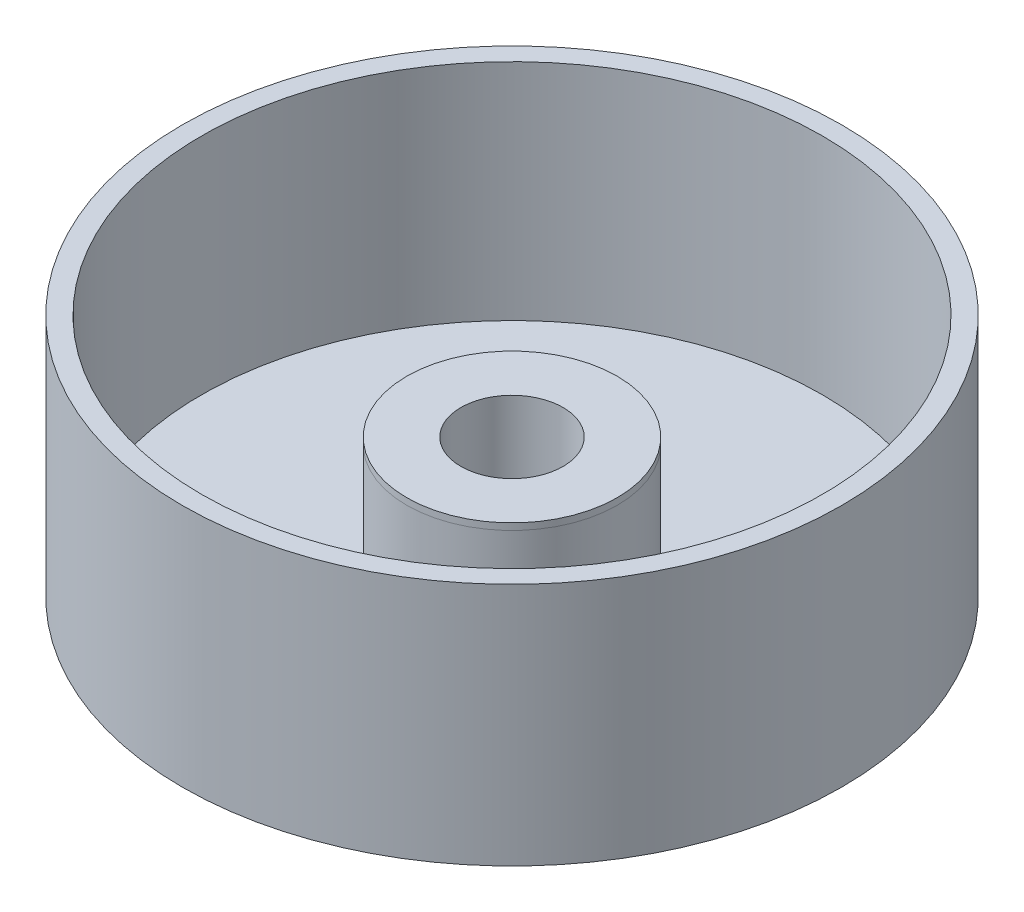
ISO-10303-21;
HEADER;
FILE_DESCRIPTION(('STEP AP214'),'2;1');
FILE_NAME('part.step','',(''),(''),'','','');
FILE_SCHEMA(('AUTOMOTIVE_DESIGN { 1 0 10303 214 1 1 1 1 }'));
ENDSEC;
DATA;
#1=APPLICATION_CONTEXT('core data for automotive mechanical design processes');
#2=APPLICATION_PROTOCOL_DEFINITION('international standard','automotive_design',2000,#1);
#3=PRODUCT_CONTEXT('',#1,'mechanical');
#4=PRODUCT('Part','Part','',(#3));
#5=PRODUCT_RELATED_PRODUCT_CATEGORY('part','',(#4));
#6=PRODUCT_DEFINITION_FORMATION('','',#4);
#7=PRODUCT_DEFINITION_CONTEXT('part definition',#1,'design');
#8=PRODUCT_DEFINITION('design','',#6,#7);
#9=PRODUCT_DEFINITION_SHAPE('','',#8);
#10=(LENGTH_UNIT() NAMED_UNIT(*) SI_UNIT(.MILLI.,.METRE.));
#11=(NAMED_UNIT(*) PLANE_ANGLE_UNIT() SI_UNIT($,.RADIAN.));
#12=(NAMED_UNIT(*) SI_UNIT($,.STERADIAN.) SOLID_ANGLE_UNIT());
#13=UNCERTAINTY_MEASURE_WITH_UNIT(LENGTH_MEASURE(1.E-05),#10,'distance_accuracy_value','');
#14=(GEOMETRIC_REPRESENTATION_CONTEXT(3) GLOBAL_UNCERTAINTY_ASSIGNED_CONTEXT((#13)) GLOBAL_UNIT_ASSIGNED_CONTEXT((#10,
#11,#12)) REPRESENTATION_CONTEXT('',''));
#15=CARTESIAN_POINT('',(0.,0.,0.));
#16=DIRECTION('',(0.,0.,1.));
#17=DIRECTION('',(1.,0.,0.));
#18=AXIS2_PLACEMENT_3D('',#15,#16,#17);
#19=CARTESIAN_POINT('',(0.,1.,0.));
#20=DIRECTION('',(0.,-1.,0.));
#21=DIRECTION('',(0.,0.,-1.));
#22=AXIS2_PLACEMENT_3D('',#19,#20,#21);
#23=CYLINDRICAL_SURFACE('',#22,15.958);
#24=CARTESIAN_POINT('',(0.,1.,0.));
#25=DIRECTION('',(0.,1.,0.));
#26=DIRECTION('',(0.,0.,1.));
#27=AXIS2_PLACEMENT_3D('',#24,#25,#26);
#28=CIRCLE('',#27,15.958);
#29=CARTESIAN_POINT('',(0.,1.,15.958));
#30=VERTEX_POINT('',#29);
#31=EDGE_CURVE('E11',#30,#30,#28,.T.);
#32=ORIENTED_EDGE('',*,*,#31,.F.);
#33=EDGE_LOOP('',(#32));
#34=FACE_BOUND('',#33,.T.);
#35=CARTESIAN_POINT('',(0.,0.,0.));
#36=DIRECTION('',(0.,1.,0.));
#37=DIRECTION('',(0.,0.,1.));
#38=AXIS2_PLACEMENT_3D('',#35,#36,#37);
#39=CIRCLE('',#38,15.958);
#40=CARTESIAN_POINT('',(0.,0.,15.958));
#41=VERTEX_POINT('',#40);
#42=EDGE_CURVE('E45',#41,#41,#39,.T.);
#43=ORIENTED_EDGE('',*,*,#42,.T.);
#44=EDGE_LOOP('',(#43));
#45=FACE_BOUND('',#44,.T.);
#46=ADVANCED_FACE('F35',(#34,#45),#23,.T.);
#47=CARTESIAN_POINT('',(0.,1.,0.));
#48=DIRECTION('',(0.,1.,0.));
#49=DIRECTION('',(0.,0.,1.));
#50=AXIS2_PLACEMENT_3D('',#47,#48,#49);
#51=PLANE('',#50);
#52=CARTESIAN_POINT('',(0.,1.,0.));
#53=DIRECTION('',(0.,1.,0.));
#54=DIRECTION('',(0.,0.,1.));
#55=AXIS2_PLACEMENT_3D('',#52,#53,#54);
#56=CIRCLE('',#55,7.75000000000001);
#57=CARTESIAN_POINT('',(0.,1.,7.75000000000001));
#58=VERTEX_POINT('',#57);
#59=EDGE_CURVE('E67',#58,#58,#56,.T.);
#60=ORIENTED_EDGE('',*,*,#59,.F.);
#61=EDGE_LOOP('',(#60));
#62=FACE_BOUND('',#61,.T.);
#63=ORIENTED_EDGE('',*,*,#31,.T.);
#64=EDGE_LOOP('',(#63));
#65=FACE_BOUND('',#64,.T.);
#66=ADVANCED_FACE('F82',(#62,#65),#51,.T.);
#67=CARTESIAN_POINT('',(0.,0.,0.));
#68=DIRECTION('',(0.,1.,0.));
#69=DIRECTION('',(0.,0.,1.));
#70=AXIS2_PLACEMENT_3D('',#67,#68,#69);
#71=PLANE('',#70);
#72=CARTESIAN_POINT('',(0.,0.,0.));
#73=DIRECTION('',(0.,1.,0.));
#74=DIRECTION('',(0.,0.,1.));
#75=AXIS2_PLACEMENT_3D('',#72,#73,#74);
#76=CIRCLE('',#75,15.9579008899185);
#77=CARTESIAN_POINT('',(0.,0.,15.9579008899185));
#78=VERTEX_POINT('',#77);
#79=EDGE_CURVE('E55',#78,#78,#76,.T.);
#80=ORIENTED_EDGE('',*,*,#79,.T.);
#81=EDGE_LOOP('',(#80));
#82=FACE_BOUND('',#81,.T.);
#83=ORIENTED_EDGE('',*,*,#42,.F.);
#84=EDGE_LOOP('',(#83));
#85=FACE_BOUND('',#84,.T.);
#86=ADVANCED_FACE('F84',(#82,#85),#71,.F.);
#87=CARTESIAN_POINT('',(0.,-153.170167860411,0.));
#88=DIRECTION('',(0.,1.,0.));
#89=DIRECTION('',(0.,0.,1.));
#90=AXIS2_PLACEMENT_3D('',#87,#88,#89);
#91=CYLINDRICAL_SURFACE('',#90,47.0827643729237);
#92=CARTESIAN_POINT('',(0.,-17.,0.));
#93=DIRECTION('',(0.,-1.,0.));
#94=DIRECTION('',(0.,0.,-1.));
#95=AXIS2_PLACEMENT_3D('',#92,#93,#94);
#96=CIRCLE('',#95,47.0827643729237);
#97=CARTESIAN_POINT('',(0.,-17.,-47.0827643729237));
#98=VERTEX_POINT('',#97);
#99=EDGE_CURVE('E52',#98,#98,#96,.F.);
#100=ORIENTED_EDGE('',*,*,#99,.F.);
#101=EDGE_LOOP('',(#100));
#102=FACE_BOUND('',#101,.T.);
#103=CARTESIAN_POINT('',(0.,17.,0.));
#104=DIRECTION('',(0.,1.,0.));
#105=DIRECTION('',(0.,0.,1.));
#106=AXIS2_PLACEMENT_3D('',#103,#104,#105);
#107=CIRCLE('',#106,47.0827643729237);
#108=CARTESIAN_POINT('',(0.,17.,47.0827643729237));
#109=VERTEX_POINT('',#108);
#110=EDGE_CURVE('E63',#109,#109,#107,.T.);
#111=ORIENTED_EDGE('',*,*,#110,.T.);
#112=EDGE_LOOP('',(#111));
#113=FACE_BOUND('',#112,.T.);
#114=ADVANCED_FACE('F89',(#102,#113),#91,.F.);
#115=CARTESIAN_POINT('',(0.,-153.170167860411,0.));
#116=DIRECTION('',(0.,1.,0.));
#117=DIRECTION('',(0.,0.,1.));
#118=AXIS2_PLACEMENT_3D('',#115,#116,#117);
#119=CYLINDRICAL_SURFACE('',#118,15.9579008899185);
#120=ORIENTED_EDGE('',*,*,#79,.F.);
#121=EDGE_LOOP('',(#120));
#122=FACE_BOUND('',#121,.T.);
#123=CARTESIAN_POINT('',(0.,-17.,0.));
#124=DIRECTION('',(0.,-1.,0.));
#125=DIRECTION('',(0.,0.,-1.));
#126=AXIS2_PLACEMENT_3D('',#123,#124,#125);
#127=CIRCLE('',#126,15.9579008899185);
#128=CARTESIAN_POINT('',(0.,-17.,-15.9579008899185));
#129=VERTEX_POINT('',#128);
#130=EDGE_CURVE('E49',#129,#129,#127,.F.);
#131=ORIENTED_EDGE('',*,*,#130,.T.);
#132=EDGE_LOOP('',(#131));
#133=FACE_BOUND('',#132,.T.);
#134=ADVANCED_FACE('F103',(#122,#133),#119,.T.);
#135=CARTESIAN_POINT('',(0.,-17.,0.));
#136=DIRECTION('',(0.,-1.,0.));
#137=DIRECTION('',(0.,0.,-1.));
#138=AXIS2_PLACEMENT_3D('',#135,#136,#137);
#139=PLANE('',#138);
#140=ORIENTED_EDGE('',*,*,#99,.T.);
#141=EDGE_LOOP('',(#140));
#142=FACE_BOUND('',#141,.T.);
#143=ORIENTED_EDGE('',*,*,#130,.F.);
#144=EDGE_LOOP('',(#143));
#145=FACE_BOUND('',#144,.T.);
#146=ADVANCED_FACE('F100',(#142,#145),#139,.F.);
#147=CARTESIAN_POINT('',(0.,17.,0.));
#148=DIRECTION('',(0.,1.,0.));
#149=DIRECTION('',(0.,0.,1.));
#150=AXIS2_PLACEMENT_3D('',#147,#148,#149);
#151=PLANE('',#150);
#152=CARTESIAN_POINT('',(0.,17.,0.));
#153=DIRECTION('',(0.,1.,0.));
#154=DIRECTION('',(0.,0.,1.));
#155=AXIS2_PLACEMENT_3D('',#152,#153,#154);
#156=CIRCLE('',#155,50.);
#157=CARTESIAN_POINT('',(0.,17.,50.));
#158=VERTEX_POINT('',#157);
#159=EDGE_CURVE('E56',#158,#158,#156,.T.);
#160=ORIENTED_EDGE('',*,*,#159,.T.);
#161=EDGE_LOOP('',(#160));
#162=FACE_BOUND('',#161,.T.);
#163=ORIENTED_EDGE('',*,*,#110,.F.);
#164=EDGE_LOOP('',(#163));
#165=FACE_BOUND('',#164,.T.);
#166=ADVANCED_FACE('F99',(#162,#165),#151,.T.);
#167=CARTESIAN_POINT('',(0.,-20.,0.));
#168=DIRECTION('',(0.,-1.,0.));
#169=DIRECTION('',(0.,0.,-1.));
#170=AXIS2_PLACEMENT_3D('',#167,#168,#169);
#171=PLANE('',#170);
#172=CARTESIAN_POINT('',(0.,-20.,0.));
#173=DIRECTION('',(0.,1.,0.));
#174=DIRECTION('',(0.,0.,1.));
#175=AXIS2_PLACEMENT_3D('',#172,#173,#174);
#176=CIRCLE('',#175,7.75000000000001);
#177=CARTESIAN_POINT('',(0.,-20.,7.75000000000001));
#178=VERTEX_POINT('',#177);
#179=EDGE_CURVE('E66',#178,#178,#176,.T.);
#180=ORIENTED_EDGE('',*,*,#179,.T.);
#181=EDGE_LOOP('',(#180));
#182=FACE_BOUND('',#181,.T.);
#183=CARTESIAN_POINT('',(0.,-20.,0.));
#184=DIRECTION('',(0.,-1.,0.));
#185=DIRECTION('',(0.,0.,-1.));
#186=AXIS2_PLACEMENT_3D('',#183,#184,#185);
#187=CIRCLE('',#186,50.);
#188=CARTESIAN_POINT('',(0.,-20.,-50.));
#189=VERTEX_POINT('',#188);
#190=EDGE_CURVE('E41',#189,#189,#187,.T.);
#191=ORIENTED_EDGE('',*,*,#190,.T.);
#192=EDGE_LOOP('',(#191));
#193=FACE_BOUND('',#192,.T.);
#194=ADVANCED_FACE('F73',(#182,#193),#171,.T.);
#195=CARTESIAN_POINT('',(0.,-20.,0.));
#196=DIRECTION('',(0.,1.,0.));
#197=DIRECTION('',(0.,0.,1.));
#198=AXIS2_PLACEMENT_3D('',#195,#196,#197);
#199=CYLINDRICAL_SURFACE('',#198,50.);
#200=ORIENTED_EDGE('',*,*,#190,.F.);
#201=EDGE_LOOP('',(#200));
#202=FACE_BOUND('',#201,.T.);
#203=ORIENTED_EDGE('',*,*,#159,.F.);
#204=EDGE_LOOP('',(#203));
#205=FACE_BOUND('',#204,.T.);
#206=ADVANCED_FACE('F78',(#202,#205),#199,.T.);
#207=CARTESIAN_POINT('',(0.,-20.,0.));
#208=DIRECTION('',(0.,1.,0.));
#209=DIRECTION('',(0.,0.,1.));
#210=AXIS2_PLACEMENT_3D('',#207,#208,#209);
#211=CYLINDRICAL_SURFACE('',#210,7.75000000000001);
#212=ORIENTED_EDGE('',*,*,#179,.F.);
#213=EDGE_LOOP('',(#212));
#214=FACE_BOUND('',#213,.T.);
#215=ORIENTED_EDGE('',*,*,#59,.T.);
#216=EDGE_LOOP('',(#215));
#217=FACE_BOUND('',#216,.T.);
#218=ADVANCED_FACE('F75',(#214,#217),#211,.F.);
#219=CLOSED_SHELL('',(#46,#66,#86,#114,#134,#146,#166,#194,#206,#218));
#220=MANIFOLD_SOLID_BREP('B2',#219);
#221=ADVANCED_BREP_SHAPE_REPRESENTATION('',(#18,#220),#14);
#222=SHAPE_DEFINITION_REPRESENTATION(#9,#221);
ENDSEC;
END-ISO-10303-21;
